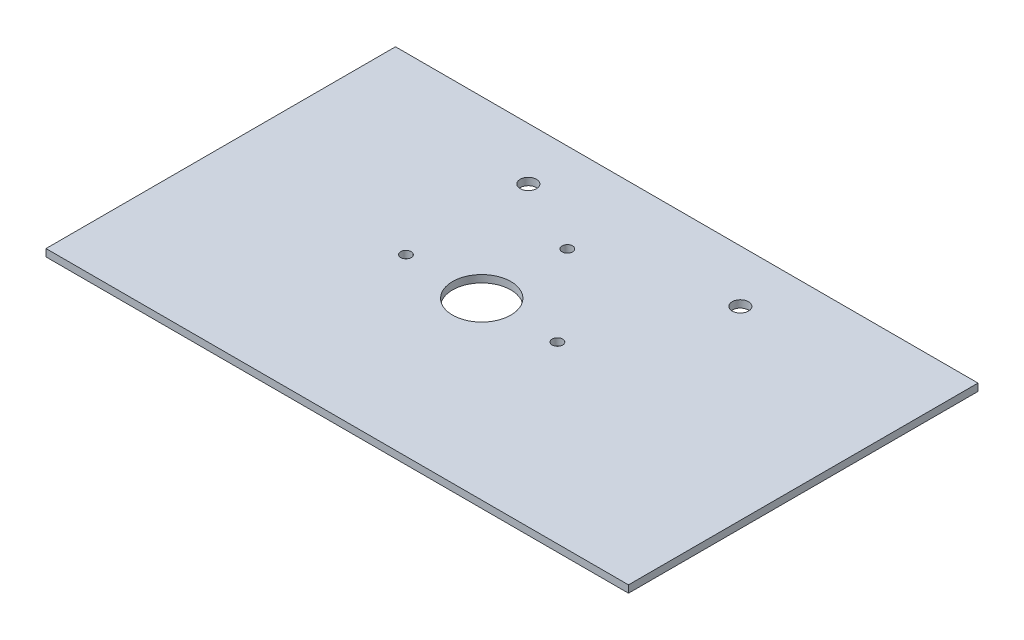
ISO-10303-21;
HEADER;
FILE_DESCRIPTION(('STEP AP214'),'2;1');
FILE_NAME('part.step','',(''),(''),'','','');
FILE_SCHEMA(('AUTOMOTIVE_DESIGN { 1 0 10303 214 1 1 1 1 }'));
ENDSEC;
DATA;
#1=APPLICATION_CONTEXT('core data for automotive mechanical design processes');
#2=APPLICATION_PROTOCOL_DEFINITION('international standard','automotive_design',2000,#1);
#3=PRODUCT_CONTEXT('',#1,'mechanical');
#4=PRODUCT('Part','Part','',(#3));
#5=PRODUCT_RELATED_PRODUCT_CATEGORY('part','',(#4));
#6=PRODUCT_DEFINITION_FORMATION('','',#4);
#7=PRODUCT_DEFINITION_CONTEXT('part definition',#1,'design');
#8=PRODUCT_DEFINITION('design','',#6,#7);
#9=PRODUCT_DEFINITION_SHAPE('','',#8);
#10=(LENGTH_UNIT() NAMED_UNIT(*) SI_UNIT(.MILLI.,.METRE.));
#11=(NAMED_UNIT(*) PLANE_ANGLE_UNIT() SI_UNIT($,.RADIAN.));
#12=(NAMED_UNIT(*) SI_UNIT($,.STERADIAN.) SOLID_ANGLE_UNIT());
#13=UNCERTAINTY_MEASURE_WITH_UNIT(LENGTH_MEASURE(1.E-05),#10,'distance_accuracy_value','');
#14=(GEOMETRIC_REPRESENTATION_CONTEXT(3) GLOBAL_UNCERTAINTY_ASSIGNED_CONTEXT((#13)) GLOBAL_UNIT_ASSIGNED_CONTEXT((#10,
#11,#12)) REPRESENTATION_CONTEXT('',''));
#15=CARTESIAN_POINT('',(0.,0.,0.));
#16=DIRECTION('',(0.,0.,1.));
#17=DIRECTION('',(1.,0.,0.));
#18=AXIS2_PLACEMENT_3D('',#15,#16,#17);
#19=CARTESIAN_POINT('',(0.,3.175,76.2));
#20=DIRECTION('',(0.,-1.,0.));
#21=DIRECTION('',(1.,0.,0.));
#22=AXIS2_PLACEMENT_3D('',#19,#20,#21);
#23=PLANE('',#22);
#24=CARTESIAN_POINT('',(-80.772,3.175,-53.34));
#25=DIRECTION('',(0.,1.,0.));
#26=DIRECTION('',(0.,0.,-1.));
#27=AXIS2_PLACEMENT_3D('',#24,#25,#26);
#28=CIRCLE('',#27,3.556);
#29=CARTESIAN_POINT('',(-80.772,3.175,-56.896));
#30=VERTEX_POINT('',#29);
#31=EDGE_CURVE('E142',#30,#30,#28,.T.);
#32=ORIENTED_EDGE('',*,*,#31,.F.);
#33=EDGE_LOOP('',(#32));
#34=FACE_BOUND('',#33,.T.);
#35=CARTESIAN_POINT('',(-173.228,3.175,-53.34));
#36=DIRECTION('',(0.,1.,0.));
#37=DIRECTION('',(0.,0.,1.));
#38=AXIS2_PLACEMENT_3D('',#35,#36,#37);
#39=CIRCLE('',#38,3.55600000000001);
#40=CARTESIAN_POINT('',(-173.228,3.175,-49.784));
#41=VERTEX_POINT('',#40);
#42=EDGE_CURVE('E136',#41,#41,#39,.T.);
#43=ORIENTED_EDGE('',*,*,#42,.F.);
#44=EDGE_LOOP('',(#43));
#45=FACE_BOUND('',#44,.T.);
#46=CARTESIAN_POINT('',(-140.208,3.175,-37.338));
#47=DIRECTION('',(0.,-1.,0.));
#48=DIRECTION('',(0.,0.,1.));
#49=AXIS2_PLACEMENT_3D('',#46,#47,#48);
#50=CIRCLE('',#49,2.28599999999998);
#51=CARTESIAN_POINT('',(-140.208,3.175,-35.052));
#52=VERTEX_POINT('',#51);
#53=EDGE_CURVE('E127',#52,#52,#50,.T.);
#54=ORIENTED_EDGE('',*,*,#53,.T.);
#55=EDGE_LOOP('',(#54));
#56=FACE_BOUND('',#55,.T.);
#57=CARTESIAN_POINT('',(-173.228,3.175,0.));
#58=DIRECTION('',(0.,-1.,0.));
#59=DIRECTION('',(0.,0.,1.));
#60=AXIS2_PLACEMENT_3D('',#57,#58,#59);
#61=CIRCLE('',#60,2.28599999999998);
#62=CARTESIAN_POINT('',(-173.228,3.175,2.28599999999998));
#63=VERTEX_POINT('',#62);
#64=EDGE_CURVE('E121',#63,#63,#61,.T.);
#65=ORIENTED_EDGE('',*,*,#64,.T.);
#66=EDGE_LOOP('',(#65));
#67=FACE_BOUND('',#66,.T.);
#68=CARTESIAN_POINT('',(-107.188,3.175,0.));
#69=DIRECTION('',(0.,-1.,0.));
#70=DIRECTION('',(0.,0.,-1.));
#71=AXIS2_PLACEMENT_3D('',#68,#69,#70);
#72=CIRCLE('',#71,2.28599999999998);
#73=CARTESIAN_POINT('',(-107.188,3.175,-2.28599999999998));
#74=VERTEX_POINT('',#73);
#75=EDGE_CURVE('E115',#74,#74,#72,.T.);
#76=ORIENTED_EDGE('',*,*,#75,.T.);
#77=EDGE_LOOP('',(#76));
#78=FACE_BOUND('',#77,.T.);
#79=CARTESIAN_POINT('',(-140.208,3.175,0.));
#80=DIRECTION('',(0.,-1.,0.));
#81=DIRECTION('',(0.,0.,-1.));
#82=AXIS2_PLACEMENT_3D('',#79,#80,#81);
#83=CIRCLE('',#82,12.7);
#84=CARTESIAN_POINT('',(-140.208,3.175,-12.7));
#85=VERTEX_POINT('',#84);
#86=EDGE_CURVE('E102',#85,#85,#83,.T.);
#87=ORIENTED_EDGE('',*,*,#86,.T.);
#88=EDGE_LOOP('',(#87));
#89=FACE_BOUND('',#88,.T.);
#90=DIRECTION('',(-1.,0.,0.));
#91=VECTOR('',#90,1.);
#92=CARTESIAN_POINT('',(0.,3.175,-76.2));
#93=LINE('',#92,#91);
#94=CARTESIAN_POINT('',(0.,3.175,-76.2));
#95=VERTEX_POINT('',#94);
#96=CARTESIAN_POINT('',(-254.,3.17499999999997,-76.2));
#97=VERTEX_POINT('',#96);
#98=EDGE_CURVE('E100',#95,#97,#93,.T.);
#99=ORIENTED_EDGE('',*,*,#98,.T.);
#100=DIRECTION('',(0.,0.,-1.));
#101=VECTOR('',#100,1.);
#102=CARTESIAN_POINT('',(-254.,3.17499999999997,76.2));
#103=LINE('',#102,#101);
#104=CARTESIAN_POINT('',(-254.,3.17499999999997,76.2));
#105=VERTEX_POINT('',#104);
#106=EDGE_CURVE('E11',#105,#97,#103,.T.);
#107=ORIENTED_EDGE('',*,*,#106,.F.);
#108=DIRECTION('',(-1.,0.,0.));
#109=VECTOR('',#108,1.);
#110=CARTESIAN_POINT('',(0.,3.175,76.2));
#111=LINE('',#110,#109);
#112=CARTESIAN_POINT('',(0.,3.175,76.2));
#113=VERTEX_POINT('',#112);
#114=EDGE_CURVE('E77',#113,#105,#111,.T.);
#115=ORIENTED_EDGE('',*,*,#114,.F.);
#116=DIRECTION('',(0.,0.,-1.));
#117=VECTOR('',#116,1.);
#118=CARTESIAN_POINT('',(0.,3.175,76.2));
#119=LINE('',#118,#117);
#120=EDGE_CURVE('E53',#113,#95,#119,.T.);
#121=ORIENTED_EDGE('',*,*,#120,.T.);
#122=EDGE_LOOP('',(#99,#107,#115,#121));
#123=FACE_BOUND('',#122,.T.);
#124=ADVANCED_FACE('F37',(#34,#45,#56,#67,#78,#89,#123),#23,.F.);
#125=CARTESIAN_POINT('',(-254.,0.,76.2));
#126=DIRECTION('',(-1.,0.,0.));
#127=DIRECTION('',(0.,0.,1.));
#128=AXIS2_PLACEMENT_3D('',#125,#126,#127);
#129=PLANE('',#128);
#130=DIRECTION('',(0.,1.,0.));
#131=VECTOR('',#130,1.);
#132=CARTESIAN_POINT('',(-254.,0.,-76.2));
#133=LINE('',#132,#131);
#134=CARTESIAN_POINT('',(-254.,0.,-76.2));
#135=VERTEX_POINT('',#134);
#136=EDGE_CURVE('E86',#135,#97,#133,.T.);
#137=ORIENTED_EDGE('',*,*,#136,.F.);
#138=DIRECTION('',(0.,0.,-1.));
#139=VECTOR('',#138,1.);
#140=CARTESIAN_POINT('',(-254.,0.,76.2));
#141=LINE('',#140,#139);
#142=CARTESIAN_POINT('',(-254.,0.,76.2));
#143=VERTEX_POINT('',#142);
#144=EDGE_CURVE('E45',#143,#135,#141,.T.);
#145=ORIENTED_EDGE('',*,*,#144,.F.);
#146=DIRECTION('',(0.,1.,0.));
#147=VECTOR('',#146,1.);
#148=CARTESIAN_POINT('',(-254.,0.,76.2));
#149=LINE('',#148,#147);
#150=EDGE_CURVE('E84',#143,#105,#149,.T.);
#151=ORIENTED_EDGE('',*,*,#150,.T.);
#152=ORIENTED_EDGE('',*,*,#106,.T.);
#153=EDGE_LOOP('',(#137,#145,#151,#152));
#154=FACE_BOUND('',#153,.T.);
#155=ADVANCED_FACE('F83',(#154),#129,.T.);
#156=CARTESIAN_POINT('',(0.,0.,76.2));
#157=DIRECTION('',(0.,-1.,0.));
#158=DIRECTION('',(1.,0.,0.));
#159=AXIS2_PLACEMENT_3D('',#156,#157,#158);
#160=PLANE('',#159);
#161=CARTESIAN_POINT('',(-80.772,0.,-53.34));
#162=DIRECTION('',(0.,1.,0.));
#163=DIRECTION('',(0.,0.,-1.));
#164=AXIS2_PLACEMENT_3D('',#161,#162,#163);
#165=CIRCLE('',#164,3.556);
#166=CARTESIAN_POINT('',(-80.772,0.,-56.896));
#167=VERTEX_POINT('',#166);
#168=EDGE_CURVE('E139',#167,#167,#165,.T.);
#169=ORIENTED_EDGE('',*,*,#168,.T.);
#170=EDGE_LOOP('',(#169));
#171=FACE_BOUND('',#170,.T.);
#172=CARTESIAN_POINT('',(-173.228,0.,-53.34));
#173=DIRECTION('',(0.,1.,0.));
#174=DIRECTION('',(0.,0.,1.));
#175=AXIS2_PLACEMENT_3D('',#172,#173,#174);
#176=CIRCLE('',#175,3.55600000000001);
#177=CARTESIAN_POINT('',(-173.228,0.,-49.784));
#178=VERTEX_POINT('',#177);
#179=EDGE_CURVE('E133',#178,#178,#176,.T.);
#180=ORIENTED_EDGE('',*,*,#179,.T.);
#181=EDGE_LOOP('',(#180));
#182=FACE_BOUND('',#181,.T.);
#183=CARTESIAN_POINT('',(-140.208,0.,-37.338));
#184=DIRECTION('',(0.,-1.,0.));
#185=DIRECTION('',(0.,0.,1.));
#186=AXIS2_PLACEMENT_3D('',#183,#184,#185);
#187=CIRCLE('',#186,2.28599999999998);
#188=CARTESIAN_POINT('',(-140.208,0.,-35.052));
#189=VERTEX_POINT('',#188);
#190=EDGE_CURVE('E130',#189,#189,#187,.T.);
#191=ORIENTED_EDGE('',*,*,#190,.F.);
#192=EDGE_LOOP('',(#191));
#193=FACE_BOUND('',#192,.T.);
#194=CARTESIAN_POINT('',(-173.228,0.,0.));
#195=DIRECTION('',(0.,-1.,0.));
#196=DIRECTION('',(0.,0.,1.));
#197=AXIS2_PLACEMENT_3D('',#194,#195,#196);
#198=CIRCLE('',#197,2.28599999999998);
#199=CARTESIAN_POINT('',(-173.228,0.,2.28599999999998));
#200=VERTEX_POINT('',#199);
#201=EDGE_CURVE('E124',#200,#200,#198,.T.);
#202=ORIENTED_EDGE('',*,*,#201,.F.);
#203=EDGE_LOOP('',(#202));
#204=FACE_BOUND('',#203,.T.);
#205=CARTESIAN_POINT('',(-107.188,0.,0.));
#206=DIRECTION('',(0.,-1.,0.));
#207=DIRECTION('',(0.,0.,-1.));
#208=AXIS2_PLACEMENT_3D('',#205,#206,#207);
#209=CIRCLE('',#208,2.28599999999998);
#210=CARTESIAN_POINT('',(-107.188,0.,-2.28599999999998));
#211=VERTEX_POINT('',#210);
#212=EDGE_CURVE('E118',#211,#211,#209,.T.);
#213=ORIENTED_EDGE('',*,*,#212,.F.);
#214=EDGE_LOOP('',(#213));
#215=FACE_BOUND('',#214,.T.);
#216=CARTESIAN_POINT('',(-140.208,0.,0.));
#217=DIRECTION('',(0.,-1.,0.));
#218=DIRECTION('',(0.,0.,-1.));
#219=AXIS2_PLACEMENT_3D('',#216,#217,#218);
#220=CIRCLE('',#219,12.7);
#221=CARTESIAN_POINT('',(-140.208,0.,-12.7));
#222=VERTEX_POINT('',#221);
#223=EDGE_CURVE('E112',#222,#222,#220,.T.);
#224=ORIENTED_EDGE('',*,*,#223,.F.);
#225=EDGE_LOOP('',(#224));
#226=FACE_BOUND('',#225,.T.);
#227=DIRECTION('',(-1.,0.,0.));
#228=VECTOR('',#227,1.);
#229=CARTESIAN_POINT('',(0.,0.,-76.2));
#230=LINE('',#229,#228);
#231=CARTESIAN_POINT('',(0.,0.,-76.2));
#232=VERTEX_POINT('',#231);
#233=EDGE_CURVE('E104',#232,#135,#230,.T.);
#234=ORIENTED_EDGE('',*,*,#233,.F.);
#235=DIRECTION('',(0.,0.,-1.));
#236=VECTOR('',#235,1.);
#237=CARTESIAN_POINT('',(0.,0.,76.2));
#238=LINE('',#237,#236);
#239=CARTESIAN_POINT('',(0.,0.,76.2));
#240=VERTEX_POINT('',#239);
#241=EDGE_CURVE('E66',#240,#232,#238,.T.);
#242=ORIENTED_EDGE('',*,*,#241,.F.);
#243=DIRECTION('',(-1.,0.,0.));
#244=VECTOR('',#243,1.);
#245=CARTESIAN_POINT('',(0.,0.,76.2));
#246=LINE('',#245,#244);
#247=EDGE_CURVE('E92',#240,#143,#246,.T.);
#248=ORIENTED_EDGE('',*,*,#247,.T.);
#249=ORIENTED_EDGE('',*,*,#144,.T.);
#250=EDGE_LOOP('',(#234,#242,#248,#249));
#251=FACE_BOUND('',#250,.T.);
#252=ADVANCED_FACE('F94',(#171,#182,#193,#204,#215,#226,#251),#160,.T.);
#253=CARTESIAN_POINT('',(0.,3.175,76.2));
#254=DIRECTION('',(1.,0.,0.));
#255=DIRECTION('',(0.,1.,0.));
#256=AXIS2_PLACEMENT_3D('',#253,#254,#255);
#257=PLANE('',#256);
#258=DIRECTION('',(0.,-1.,0.));
#259=VECTOR('',#258,1.);
#260=CARTESIAN_POINT('',(0.,3.175,-76.2));
#261=LINE('',#260,#259);
#262=EDGE_CURVE('E106',#95,#232,#261,.T.);
#263=ORIENTED_EDGE('',*,*,#262,.F.);
#264=ORIENTED_EDGE('',*,*,#120,.F.);
#265=DIRECTION('',(0.,-1.,0.));
#266=VECTOR('',#265,1.);
#267=CARTESIAN_POINT('',(0.,3.175,76.2));
#268=LINE('',#267,#266);
#269=EDGE_CURVE('E95',#113,#240,#268,.T.);
#270=ORIENTED_EDGE('',*,*,#269,.T.);
#271=ORIENTED_EDGE('',*,*,#241,.T.);
#272=EDGE_LOOP('',(#263,#264,#270,#271));
#273=FACE_BOUND('',#272,.T.);
#274=ADVANCED_FACE('F179',(#273),#257,.T.);
#275=CARTESIAN_POINT('',(0.,0.,76.2));
#276=DIRECTION('',(0.,0.,-1.));
#277=DIRECTION('',(-1.,0.,0.));
#278=AXIS2_PLACEMENT_3D('',#275,#276,#277);
#279=PLANE('',#278);
#280=ORIENTED_EDGE('',*,*,#114,.T.);
#281=ORIENTED_EDGE('',*,*,#150,.F.);
#282=ORIENTED_EDGE('',*,*,#247,.F.);
#283=ORIENTED_EDGE('',*,*,#269,.F.);
#284=EDGE_LOOP('',(#280,#281,#282,#283));
#285=FACE_BOUND('',#284,.T.);
#286=ADVANCED_FACE('F91',(#285),#279,.F.);
#287=CARTESIAN_POINT('',(0.,0.,-76.2));
#288=DIRECTION('',(0.,0.,-1.));
#289=DIRECTION('',(-1.,0.,0.));
#290=AXIS2_PLACEMENT_3D('',#287,#288,#289);
#291=PLANE('',#290);
#292=ORIENTED_EDGE('',*,*,#98,.F.);
#293=ORIENTED_EDGE('',*,*,#262,.T.);
#294=ORIENTED_EDGE('',*,*,#233,.T.);
#295=ORIENTED_EDGE('',*,*,#136,.T.);
#296=EDGE_LOOP('',(#292,#293,#294,#295));
#297=FACE_BOUND('',#296,.T.);
#298=ADVANCED_FACE('F168',(#297),#291,.T.);
#299=CARTESIAN_POINT('',(-140.208,3.175,0.));
#300=DIRECTION('',(0.,-1.,0.));
#301=DIRECTION('',(0.,0.,-1.));
#302=AXIS2_PLACEMENT_3D('',#299,#300,#301);
#303=CYLINDRICAL_SURFACE('',#302,12.7);
#304=ORIENTED_EDGE('',*,*,#86,.F.);
#305=EDGE_LOOP('',(#304));
#306=FACE_BOUND('',#305,.T.);
#307=ORIENTED_EDGE('',*,*,#223,.T.);
#308=EDGE_LOOP('',(#307));
#309=FACE_BOUND('',#308,.T.);
#310=ADVANCED_FACE('F170',(#306,#309),#303,.F.);
#311=CARTESIAN_POINT('',(-107.188,3.175,0.));
#312=DIRECTION('',(0.,-1.,0.));
#313=DIRECTION('',(0.,0.,-1.));
#314=AXIS2_PLACEMENT_3D('',#311,#312,#313);
#315=CYLINDRICAL_SURFACE('',#314,2.28599999999998);
#316=ORIENTED_EDGE('',*,*,#75,.F.);
#317=EDGE_LOOP('',(#316));
#318=FACE_BOUND('',#317,.T.);
#319=ORIENTED_EDGE('',*,*,#212,.T.);
#320=EDGE_LOOP('',(#319));
#321=FACE_BOUND('',#320,.T.);
#322=ADVANCED_FACE('F176',(#318,#321),#315,.F.);
#323=CARTESIAN_POINT('',(-173.228,3.175,0.));
#324=DIRECTION('',(0.,-1.,0.));
#325=DIRECTION('',(0.,0.,-1.));
#326=AXIS2_PLACEMENT_3D('',#323,#324,#325);
#327=CYLINDRICAL_SURFACE('',#326,2.28599999999998);
#328=ORIENTED_EDGE('',*,*,#64,.F.);
#329=EDGE_LOOP('',(#328));
#330=FACE_BOUND('',#329,.T.);
#331=ORIENTED_EDGE('',*,*,#201,.T.);
#332=EDGE_LOOP('',(#331));
#333=FACE_BOUND('',#332,.T.);
#334=ADVANCED_FACE('F225',(#330,#333),#327,.F.);
#335=CARTESIAN_POINT('',(-140.208,3.175,-37.338));
#336=DIRECTION('',(0.,-1.,0.));
#337=DIRECTION('',(0.,0.,-1.));
#338=AXIS2_PLACEMENT_3D('',#335,#336,#337);
#339=CYLINDRICAL_SURFACE('',#338,2.28599999999998);
#340=ORIENTED_EDGE('',*,*,#53,.F.);
#341=EDGE_LOOP('',(#340));
#342=FACE_BOUND('',#341,.T.);
#343=ORIENTED_EDGE('',*,*,#190,.T.);
#344=EDGE_LOOP('',(#343));
#345=FACE_BOUND('',#344,.T.);
#346=ADVANCED_FACE('F236',(#342,#345),#339,.F.);
#347=CARTESIAN_POINT('',(-173.228,0.,-53.34));
#348=DIRECTION('',(0.,1.,0.));
#349=DIRECTION('',(0.,0.,1.));
#350=AXIS2_PLACEMENT_3D('',#347,#348,#349);
#351=CYLINDRICAL_SURFACE('',#350,3.55600000000001);
#352=ORIENTED_EDGE('',*,*,#179,.F.);
#353=EDGE_LOOP('',(#352));
#354=FACE_BOUND('',#353,.T.);
#355=ORIENTED_EDGE('',*,*,#42,.T.);
#356=EDGE_LOOP('',(#355));
#357=FACE_BOUND('',#356,.T.);
#358=ADVANCED_FACE('F153',(#354,#357),#351,.F.);
#359=CARTESIAN_POINT('',(-80.772,0.,-53.34));
#360=DIRECTION('',(0.,1.,0.));
#361=DIRECTION('',(0.,0.,1.));
#362=AXIS2_PLACEMENT_3D('',#359,#360,#361);
#363=CYLINDRICAL_SURFACE('',#362,3.556);
#364=ORIENTED_EDGE('',*,*,#168,.F.);
#365=EDGE_LOOP('',(#364));
#366=FACE_BOUND('',#365,.T.);
#367=ORIENTED_EDGE('',*,*,#31,.T.);
#368=EDGE_LOOP('',(#367));
#369=FACE_BOUND('',#368,.T.);
#370=ADVANCED_FACE('F150',(#366,#369),#363,.F.);
#371=CLOSED_SHELL('',(#124,#155,#252,#274,#286,#298,#310,#322,#334,#346,#358,#370));
#372=MANIFOLD_SOLID_BREP('B2',#371);
#373=ADVANCED_BREP_SHAPE_REPRESENTATION('',(#18,#372),#14);
#374=SHAPE_DEFINITION_REPRESENTATION(#9,#373);
ENDSEC;
END-ISO-10303-21;
